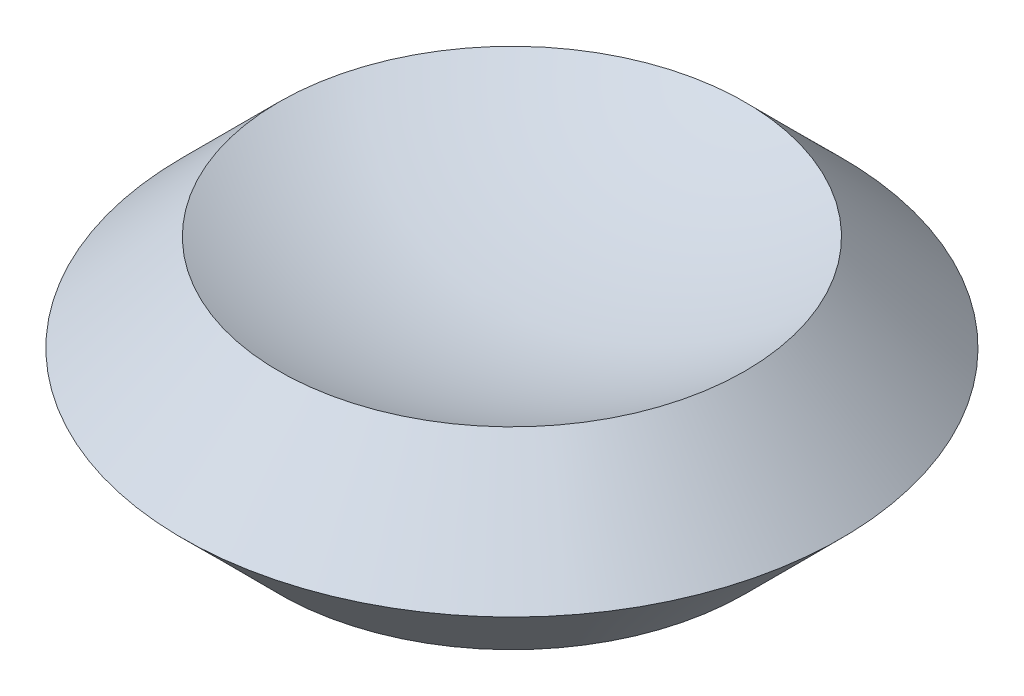
ISO-10303-21;
HEADER;
FILE_DESCRIPTION(('STEP AP214'),'2;1');
FILE_NAME('part.step','',(''),(''),'','','');
FILE_SCHEMA(('AUTOMOTIVE_DESIGN { 1 0 10303 214 1 1 1 1 }'));
ENDSEC;
DATA;
#1=APPLICATION_CONTEXT('core data for automotive mechanical design processes');
#2=APPLICATION_PROTOCOL_DEFINITION('international standard','automotive_design',2000,#1);
#3=PRODUCT_CONTEXT('',#1,'mechanical');
#4=PRODUCT('Part','Part','',(#3));
#5=PRODUCT_RELATED_PRODUCT_CATEGORY('part','',(#4));
#6=PRODUCT_DEFINITION_FORMATION('','',#4);
#7=PRODUCT_DEFINITION_CONTEXT('part definition',#1,'design');
#8=PRODUCT_DEFINITION('design','',#6,#7);
#9=PRODUCT_DEFINITION_SHAPE('','',#8);
#10=(LENGTH_UNIT() NAMED_UNIT(*) SI_UNIT(.MILLI.,.METRE.));
#11=(NAMED_UNIT(*) PLANE_ANGLE_UNIT() SI_UNIT($,.RADIAN.));
#12=(NAMED_UNIT(*) SI_UNIT($,.STERADIAN.) SOLID_ANGLE_UNIT());
#13=UNCERTAINTY_MEASURE_WITH_UNIT(LENGTH_MEASURE(1.E-05),#10,'distance_accuracy_value','');
#14=(GEOMETRIC_REPRESENTATION_CONTEXT(3) GLOBAL_UNCERTAINTY_ASSIGNED_CONTEXT((#13)) GLOBAL_UNIT_ASSIGNED_CONTEXT((#10,
#11,#12)) REPRESENTATION_CONTEXT('',''));
#15=CARTESIAN_POINT('',(0.,0.,0.));
#16=DIRECTION('',(0.,0.,1.));
#17=DIRECTION('',(1.,0.,0.));
#18=AXIS2_PLACEMENT_3D('',#15,#16,#17);
#19=CARTESIAN_POINT('',(-36.23,0.,0.));
#20=DIRECTION('',(0.,-1.,0.));
#21=DIRECTION('',(1.,0.,0.));
#22=AXIS2_PLACEMENT_3D('',#19,#20,#21);
#23=PLANE('',#22);
#24=CARTESIAN_POINT('',(0.,0.,0.));
#25=DIRECTION('',(0.,1.,0.));
#26=DIRECTION('',(-1.,0.,0.));
#27=AXIS2_PLACEMENT_3D('',#24,#25,#26);
#28=CIRCLE('',#27,36.23);
#29=CARTESIAN_POINT('',(-36.23,0.,0.));
#30=VERTEX_POINT('',#29);
#31=EDGE_CURVE('E40',#30,#30,#28,.T.);
#32=ORIENTED_EDGE('',*,*,#31,.F.);
#33=EDGE_LOOP('',(#32));
#34=FACE_BOUND('',#33,.T.);
#35=ADVANCED_FACE('F30',(#34),#23,.T.);
#36=CARTESIAN_POINT('',(0.,101.363552479815,0.));
#37=DIRECTION('',(0.,1.,0.));
#38=DIRECTION('',(1.,0.,0.));
#39=AXIS2_PLACEMENT_3D('',#36,#37,#38);
#40=SPHERICAL_SURFACE('',#39,80.0335524798154);
#41=CARTESIAN_POINT('',(0.,30.,0.));
#42=DIRECTION('',(0.,1.,0.));
#43=DIRECTION('',(-1.,0.,0.));
#44=AXIS2_PLACEMENT_3D('',#41,#42,#43);
#45=CIRCLE('',#44,36.23);
#46=CARTESIAN_POINT('',(-36.23,30.,0.));
#47=VERTEX_POINT('',#46);
#48=EDGE_CURVE('E10',#47,#47,#45,.T.);
#49=ORIENTED_EDGE('',*,*,#48,.T.);
#50=EDGE_LOOP('',(#49));
#51=FACE_BOUND('',#50,.T.);
#52=ADVANCED_FACE('F51',(#51),#40,.F.);
#53=CARTESIAN_POINT('',(0.,30.,0.));
#54=DIRECTION('',(0.,-1.,0.));
#55=DIRECTION('',(1.,0.,0.));
#56=AXIS2_PLACEMENT_3D('',#53,#54,#55);
#57=CONICAL_SURFACE('',#56,36.23,0.785398163397449);
#58=CARTESIAN_POINT('',(0.,15.,0.));
#59=DIRECTION('',(0.,1.,0.));
#60=DIRECTION('',(-1.,0.,0.));
#61=AXIS2_PLACEMENT_3D('',#58,#59,#60);
#62=CIRCLE('',#61,51.23);
#63=CARTESIAN_POINT('',(-51.23,15.,0.));
#64=VERTEX_POINT('',#63);
#65=EDGE_CURVE('E36',#64,#64,#62,.T.);
#66=ORIENTED_EDGE('',*,*,#65,.T.);
#67=EDGE_LOOP('',(#66));
#68=FACE_BOUND('',#67,.T.);
#69=ORIENTED_EDGE('',*,*,#48,.F.);
#70=EDGE_LOOP('',(#69));
#71=FACE_BOUND('',#70,.T.);
#72=ADVANCED_FACE('F55',(#68,#71),#57,.T.);
#73=CARTESIAN_POINT('',(0.,15.,0.));
#74=DIRECTION('',(0.,1.,0.));
#75=DIRECTION('',(-1.,0.,0.));
#76=AXIS2_PLACEMENT_3D('',#73,#74,#75);
#77=CONICAL_SURFACE('',#76,51.23,0.785398163397448);
#78=ORIENTED_EDGE('',*,*,#31,.T.);
#79=EDGE_LOOP('',(#78));
#80=FACE_BOUND('',#79,.T.);
#81=ORIENTED_EDGE('',*,*,#65,.F.);
#82=EDGE_LOOP('',(#81));
#83=FACE_BOUND('',#82,.T.);
#84=ADVANCED_FACE('F47',(#80,#83),#77,.T.);
#85=CLOSED_SHELL('',(#35,#52,#72,#84));
#86=MANIFOLD_SOLID_BREP('B2',#85);
#87=ADVANCED_BREP_SHAPE_REPRESENTATION('',(#18,#86),#14);
#88=SHAPE_DEFINITION_REPRESENTATION(#9,#87);
ENDSEC;
END-ISO-10303-21;
